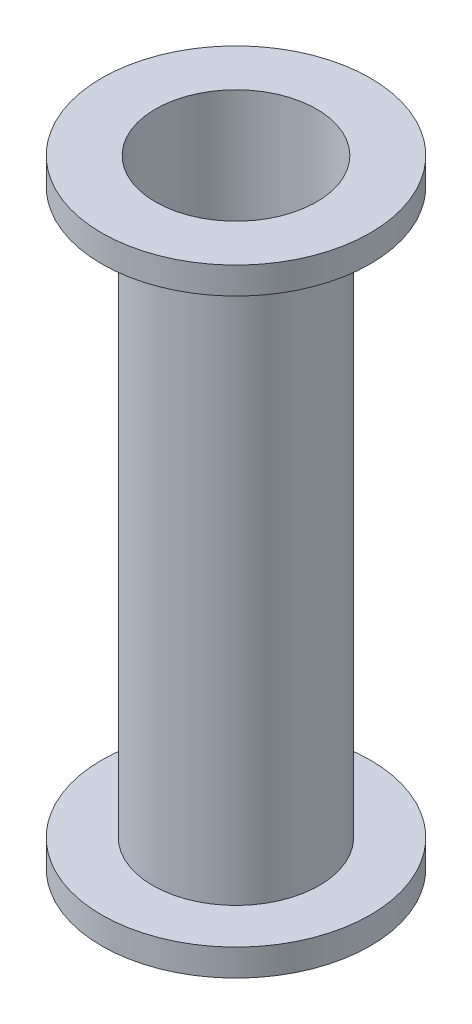
ISO-10303-21;
HEADER;
FILE_DESCRIPTION(('STEP AP214'),'2;1');
FILE_NAME('part.step','',(''),(''),'','','');
FILE_SCHEMA(('AUTOMOTIVE_DESIGN { 1 0 10303 214 1 1 1 1 }'));
ENDSEC;
DATA;
#1=APPLICATION_CONTEXT('core data for automotive mechanical design processes');
#2=APPLICATION_PROTOCOL_DEFINITION('international standard','automotive_design',2000,#1);
#3=PRODUCT_CONTEXT('',#1,'mechanical');
#4=PRODUCT('Part','Part','',(#3));
#5=PRODUCT_RELATED_PRODUCT_CATEGORY('part','',(#4));
#6=PRODUCT_DEFINITION_FORMATION('','',#4);
#7=PRODUCT_DEFINITION_CONTEXT('part definition',#1,'design');
#8=PRODUCT_DEFINITION('design','',#6,#7);
#9=PRODUCT_DEFINITION_SHAPE('','',#8);
#10=(LENGTH_UNIT() NAMED_UNIT(*) SI_UNIT(.MILLI.,.METRE.));
#11=(NAMED_UNIT(*) PLANE_ANGLE_UNIT() SI_UNIT($,.RADIAN.));
#12=(NAMED_UNIT(*) SI_UNIT($,.STERADIAN.) SOLID_ANGLE_UNIT());
#13=UNCERTAINTY_MEASURE_WITH_UNIT(LENGTH_MEASURE(1.E-05),#10,'distance_accuracy_value','');
#14=(GEOMETRIC_REPRESENTATION_CONTEXT(3) GLOBAL_UNCERTAINTY_ASSIGNED_CONTEXT((#13)) GLOBAL_UNIT_ASSIGNED_CONTEXT((#10,
#11,#12)) REPRESENTATION_CONTEXT('',''));
#15=CARTESIAN_POINT('',(0.,0.,0.));
#16=DIRECTION('',(0.,0.,1.));
#17=DIRECTION('',(1.,0.,0.));
#18=AXIS2_PLACEMENT_3D('',#15,#16,#17);
#19=CARTESIAN_POINT('',(0.,292.1,0.));
#20=DIRECTION('',(0.,-1.,0.));
#21=DIRECTION('',(0.,0.,-1.));
#22=AXIS2_PLACEMENT_3D('',#19,#20,#21);
#23=CYLINDRICAL_SURFACE('',#22,39.37);
#24=CARTESIAN_POINT('',(0.,12.7,0.));
#25=DIRECTION('',(0.,-1.,0.));
#26=DIRECTION('',(0.,0.,-1.));
#27=AXIS2_PLACEMENT_3D('',#24,#25,#26);
#28=CIRCLE('',#27,39.37);
#29=CARTESIAN_POINT('',(0.,12.7,-39.37));
#30=VERTEX_POINT('',#29);
#31=EDGE_CURVE('E40',#30,#30,#28,.T.);
#32=ORIENTED_EDGE('',*,*,#31,.F.);
#33=EDGE_LOOP('',(#32));
#34=FACE_BOUND('',#33,.T.);
#35=CARTESIAN_POINT('',(0.,279.4,0.));
#36=DIRECTION('',(0.,1.,0.));
#37=DIRECTION('',(0.,0.,1.));
#38=AXIS2_PLACEMENT_3D('',#35,#36,#37);
#39=CIRCLE('',#38,39.37);
#40=CARTESIAN_POINT('',(0.,279.4,39.37));
#41=VERTEX_POINT('',#40);
#42=EDGE_CURVE('E10',#41,#41,#39,.T.);
#43=ORIENTED_EDGE('',*,*,#42,.F.);
#44=EDGE_LOOP('',(#43));
#45=FACE_BOUND('',#44,.T.);
#46=ADVANCED_FACE('F33',(#34,#45),#23,.T.);
#47=CARTESIAN_POINT('',(0.,292.1,0.));
#48=DIRECTION('',(0.,1.,0.));
#49=DIRECTION('',(0.,0.,1.));
#50=AXIS2_PLACEMENT_3D('',#47,#48,#49);
#51=PLANE('',#50);
#52=CARTESIAN_POINT('',(0.,292.1,0.));
#53=DIRECTION('',(0.,1.,0.));
#54=DIRECTION('',(0.,0.,1.));
#55=AXIS2_PLACEMENT_3D('',#52,#53,#54);
#56=CIRCLE('',#55,38.1);
#57=CARTESIAN_POINT('',(0.,292.1,38.1));
#58=VERTEX_POINT('',#57);
#59=EDGE_CURVE('E45',#58,#58,#56,.T.);
#60=ORIENTED_EDGE('',*,*,#59,.F.);
#61=EDGE_LOOP('',(#60));
#62=FACE_BOUND('',#61,.T.);
#63=CARTESIAN_POINT('',(0.,292.1,0.));
#64=DIRECTION('',(0.,1.,0.));
#65=DIRECTION('',(0.,0.,1.));
#66=AXIS2_PLACEMENT_3D('',#63,#64,#65);
#67=CIRCLE('',#66,63.5);
#68=CARTESIAN_POINT('',(0.,292.1,63.5));
#69=VERTEX_POINT('',#68);
#70=EDGE_CURVE('E49',#69,#69,#67,.T.);
#71=ORIENTED_EDGE('',*,*,#70,.T.);
#72=EDGE_LOOP('',(#71));
#73=FACE_BOUND('',#72,.T.);
#74=ADVANCED_FACE('F77',(#62,#73),#51,.T.);
#75=CARTESIAN_POINT('',(0.,0.,0.));
#76=DIRECTION('',(0.,1.,0.));
#77=DIRECTION('',(0.,0.,1.));
#78=AXIS2_PLACEMENT_3D('',#75,#76,#77);
#79=PLANE('',#78);
#80=CARTESIAN_POINT('',(0.,0.,0.));
#81=DIRECTION('',(0.,1.,0.));
#82=DIRECTION('',(0.,0.,1.));
#83=AXIS2_PLACEMENT_3D('',#80,#81,#82);
#84=CIRCLE('',#83,38.1);
#85=CARTESIAN_POINT('',(0.,0.,38.1));
#86=VERTEX_POINT('',#85);
#87=EDGE_CURVE('E36',#86,#86,#84,.T.);
#88=ORIENTED_EDGE('',*,*,#87,.T.);
#89=EDGE_LOOP('',(#88));
#90=FACE_BOUND('',#89,.T.);
#91=CARTESIAN_POINT('',(0.,0.,0.));
#92=DIRECTION('',(0.,-1.,0.));
#93=DIRECTION('',(0.,0.,-1.));
#94=AXIS2_PLACEMENT_3D('',#91,#92,#93);
#95=CIRCLE('',#94,63.5);
#96=CARTESIAN_POINT('',(0.,0.,-63.5));
#97=VERTEX_POINT('',#96);
#98=EDGE_CURVE('E54',#97,#97,#95,.T.);
#99=ORIENTED_EDGE('',*,*,#98,.T.);
#100=EDGE_LOOP('',(#99));
#101=FACE_BOUND('',#100,.T.);
#102=ADVANCED_FACE('F63',(#90,#101),#79,.F.);
#103=CARTESIAN_POINT('',(0.,292.1,0.));
#104=DIRECTION('',(0.,-1.,0.));
#105=DIRECTION('',(0.,0.,-1.));
#106=AXIS2_PLACEMENT_3D('',#103,#104,#105);
#107=CYLINDRICAL_SURFACE('',#106,38.1);
#108=ORIENTED_EDGE('',*,*,#59,.T.);
#109=EDGE_LOOP('',(#108));
#110=FACE_BOUND('',#109,.T.);
#111=ORIENTED_EDGE('',*,*,#87,.F.);
#112=EDGE_LOOP('',(#111));
#113=FACE_BOUND('',#112,.T.);
#114=ADVANCED_FACE('F66',(#110,#113),#107,.F.);
#115=CARTESIAN_POINT('',(0.,12.7,0.));
#116=DIRECTION('',(0.,-1.,0.));
#117=DIRECTION('',(0.,0.,-1.));
#118=AXIS2_PLACEMENT_3D('',#115,#116,#117);
#119=PLANE('',#118);
#120=CARTESIAN_POINT('',(0.,12.7,0.));
#121=DIRECTION('',(0.,-1.,0.));
#122=DIRECTION('',(0.,0.,-1.));
#123=AXIS2_PLACEMENT_3D('',#120,#121,#122);
#124=CIRCLE('',#123,63.5);
#125=CARTESIAN_POINT('',(0.,12.7,-63.5));
#126=VERTEX_POINT('',#125);
#127=EDGE_CURVE('E51',#126,#126,#124,.T.);
#128=ORIENTED_EDGE('',*,*,#127,.F.);
#129=EDGE_LOOP('',(#128));
#130=FACE_BOUND('',#129,.T.);
#131=ORIENTED_EDGE('',*,*,#31,.T.);
#132=EDGE_LOOP('',(#131));
#133=FACE_BOUND('',#132,.T.);
#134=ADVANCED_FACE('F68',(#130,#133),#119,.F.);
#135=CARTESIAN_POINT('',(0.,12.7,0.));
#136=DIRECTION('',(0.,-1.,0.));
#137=DIRECTION('',(0.,0.,-1.));
#138=AXIS2_PLACEMENT_3D('',#135,#136,#137);
#139=CYLINDRICAL_SURFACE('',#138,63.5);
#140=ORIENTED_EDGE('',*,*,#127,.T.);
#141=EDGE_LOOP('',(#140));
#142=FACE_BOUND('',#141,.T.);
#143=ORIENTED_EDGE('',*,*,#98,.F.);
#144=EDGE_LOOP('',(#143));
#145=FACE_BOUND('',#144,.T.);
#146=ADVANCED_FACE('F74',(#142,#145),#139,.T.);
#147=CARTESIAN_POINT('',(0.,279.4,0.));
#148=DIRECTION('',(0.,1.,0.));
#149=DIRECTION('',(0.,0.,1.));
#150=AXIS2_PLACEMENT_3D('',#147,#148,#149);
#151=PLANE('',#150);
#152=CARTESIAN_POINT('',(0.,279.4,0.));
#153=DIRECTION('',(0.,1.,0.));
#154=DIRECTION('',(0.,0.,1.));
#155=AXIS2_PLACEMENT_3D('',#152,#153,#154);
#156=CIRCLE('',#155,63.5);
#157=CARTESIAN_POINT('',(0.,279.4,63.5));
#158=VERTEX_POINT('',#157);
#159=EDGE_CURVE('E56',#158,#158,#156,.T.);
#160=ORIENTED_EDGE('',*,*,#159,.F.);
#161=EDGE_LOOP('',(#160));
#162=FACE_BOUND('',#161,.T.);
#163=ORIENTED_EDGE('',*,*,#42,.T.);
#164=EDGE_LOOP('',(#163));
#165=FACE_BOUND('',#164,.T.);
#166=ADVANCED_FACE('F100',(#162,#165),#151,.F.);
#167=CARTESIAN_POINT('',(0.,279.4,0.));
#168=DIRECTION('',(0.,1.,0.));
#169=DIRECTION('',(0.,0.,1.));
#170=AXIS2_PLACEMENT_3D('',#167,#168,#169);
#171=CYLINDRICAL_SURFACE('',#170,63.5);
#172=ORIENTED_EDGE('',*,*,#159,.T.);
#173=EDGE_LOOP('',(#172));
#174=FACE_BOUND('',#173,.T.);
#175=ORIENTED_EDGE('',*,*,#70,.F.);
#176=EDGE_LOOP('',(#175));
#177=FACE_BOUND('',#176,.T.);
#178=ADVANCED_FACE('F98',(#174,#177),#171,.T.);
#179=CLOSED_SHELL('',(#46,#74,#102,#114,#134,#146,#166,#178));
#180=MANIFOLD_SOLID_BREP('B2',#179);
#181=ADVANCED_BREP_SHAPE_REPRESENTATION('',(#18,#180),#14);
#182=SHAPE_DEFINITION_REPRESENTATION(#9,#181);
ENDSEC;
END-ISO-10303-21;
